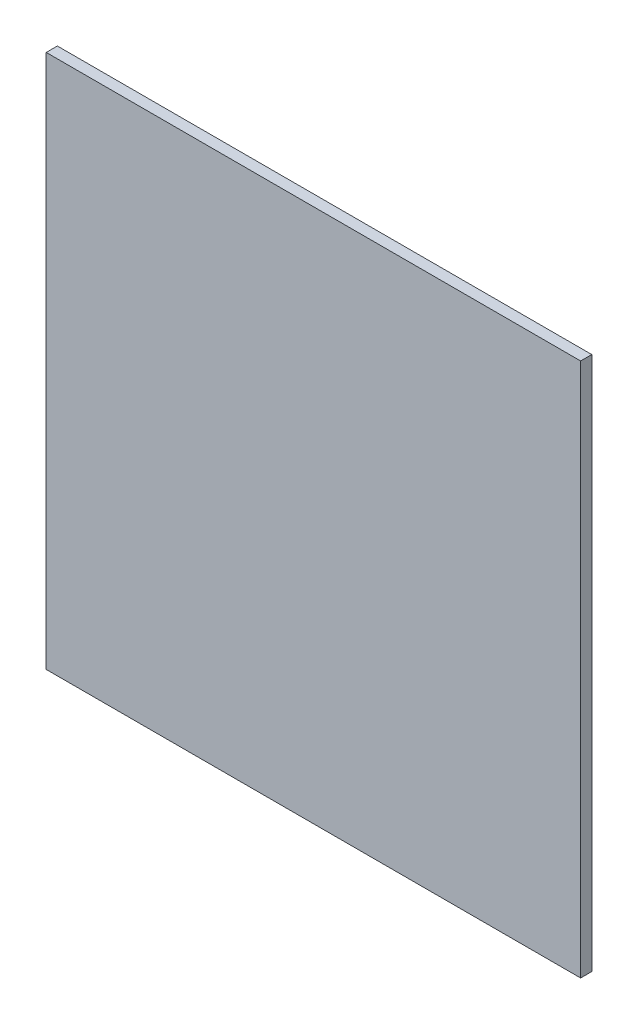
ISO-10303-21;
HEADER;
FILE_DESCRIPTION(('STEP AP214'),'2;1');
FILE_NAME('part.step','',(''),(''),'','','');
FILE_SCHEMA(('AUTOMOTIVE_DESIGN { 1 0 10303 214 1 1 1 1 }'));
ENDSEC;
DATA;
#1=APPLICATION_CONTEXT('core data for automotive mechanical design processes');
#2=APPLICATION_PROTOCOL_DEFINITION('international standard','automotive_design',2000,#1);
#3=PRODUCT_CONTEXT('',#1,'mechanical');
#4=PRODUCT('Part','Part','',(#3));
#5=PRODUCT_RELATED_PRODUCT_CATEGORY('part','',(#4));
#6=PRODUCT_DEFINITION_FORMATION('','',#4);
#7=PRODUCT_DEFINITION_CONTEXT('part definition',#1,'design');
#8=PRODUCT_DEFINITION('design','',#6,#7);
#9=PRODUCT_DEFINITION_SHAPE('','',#8);
#10=(LENGTH_UNIT() NAMED_UNIT(*) SI_UNIT(.MILLI.,.METRE.));
#11=(NAMED_UNIT(*) PLANE_ANGLE_UNIT() SI_UNIT($,.RADIAN.));
#12=(NAMED_UNIT(*) SI_UNIT($,.STERADIAN.) SOLID_ANGLE_UNIT());
#13=UNCERTAINTY_MEASURE_WITH_UNIT(LENGTH_MEASURE(1.E-05),#10,'distance_accuracy_value','');
#14=(GEOMETRIC_REPRESENTATION_CONTEXT(3) GLOBAL_UNCERTAINTY_ASSIGNED_CONTEXT((#13)) GLOBAL_UNIT_ASSIGNED_CONTEXT((#10,
#11,#12)) REPRESENTATION_CONTEXT('',''));
#15=CARTESIAN_POINT('',(0.,0.,0.));
#16=DIRECTION('',(0.,0.,1.));
#17=DIRECTION('',(1.,0.,0.));
#18=AXIS2_PLACEMENT_3D('',#15,#16,#17);
#19=CARTESIAN_POINT('',(304.8,-304.8,12.7));
#20=DIRECTION('',(-1.,0.,0.));
#21=DIRECTION('',(0.,0.,1.));
#22=AXIS2_PLACEMENT_3D('',#19,#20,#21);
#23=PLANE('',#22);
#24=DIRECTION('',(0.,1.,0.));
#25=VECTOR('',#24,1.);
#26=CARTESIAN_POINT('',(304.8,-304.8,0.));
#27=LINE('',#26,#25);
#28=CARTESIAN_POINT('',(304.8,-304.8,0.));
#29=VERTEX_POINT('',#28);
#30=CARTESIAN_POINT('',(304.8,304.8,0.));
#31=VERTEX_POINT('',#30);
#32=EDGE_CURVE('E96',#29,#31,#27,.T.);
#33=ORIENTED_EDGE('',*,*,#32,.T.);
#34=DIRECTION('',(0.,0.,-1.));
#35=VECTOR('',#34,1.);
#36=CARTESIAN_POINT('',(304.8,304.8,12.7));
#37=LINE('',#36,#35);
#38=CARTESIAN_POINT('',(304.8,304.8,12.7));
#39=VERTEX_POINT('',#38);
#40=EDGE_CURVE('E11',#39,#31,#37,.T.);
#41=ORIENTED_EDGE('',*,*,#40,.F.);
#42=DIRECTION('',(0.,1.,0.));
#43=VECTOR('',#42,1.);
#44=CARTESIAN_POINT('',(304.8,-304.8,12.7));
#45=LINE('',#44,#43);
#46=CARTESIAN_POINT('',(304.8,-304.8,12.7));
#47=VERTEX_POINT('',#46);
#48=EDGE_CURVE('E84',#47,#39,#45,.T.);
#49=ORIENTED_EDGE('',*,*,#48,.F.);
#50=DIRECTION('',(0.,0.,-1.));
#51=VECTOR('',#50,1.);
#52=CARTESIAN_POINT('',(304.8,-304.8,12.7));
#53=LINE('',#52,#51);
#54=EDGE_CURVE('E92',#47,#29,#53,.T.);
#55=ORIENTED_EDGE('',*,*,#54,.T.);
#56=EDGE_LOOP('',(#33,#41,#49,#55));
#57=FACE_BOUND('',#56,.T.);
#58=ADVANCED_FACE('F33',(#57),#23,.F.);
#59=CARTESIAN_POINT('',(-304.8,304.8,12.7));
#60=DIRECTION('',(0.,-1.,0.));
#61=DIRECTION('',(0.,0.,-1.));
#62=AXIS2_PLACEMENT_3D('',#59,#60,#61);
#63=PLANE('',#62);
#64=DIRECTION('',(-1.,0.,0.));
#65=VECTOR('',#64,1.);
#66=CARTESIAN_POINT('',(-304.8,304.8,0.));
#67=LINE('',#66,#65);
#68=CARTESIAN_POINT('',(-304.8,304.8,0.));
#69=VERTEX_POINT('',#68);
#70=EDGE_CURVE('E88',#31,#69,#67,.T.);
#71=ORIENTED_EDGE('',*,*,#70,.T.);
#72=DIRECTION('',(0.,0.,-1.));
#73=VECTOR('',#72,1.);
#74=CARTESIAN_POINT('',(-304.8,304.8,12.7));
#75=LINE('',#74,#73);
#76=CARTESIAN_POINT('',(-304.8,304.8,12.7));
#77=VERTEX_POINT('',#76);
#78=EDGE_CURVE('E41',#77,#69,#75,.T.);
#79=ORIENTED_EDGE('',*,*,#78,.F.);
#80=DIRECTION('',(-1.,0.,0.));
#81=VECTOR('',#80,1.);
#82=CARTESIAN_POINT('',(-304.8,304.8,12.7));
#83=LINE('',#82,#81);
#84=EDGE_CURVE('E79',#39,#77,#83,.T.);
#85=ORIENTED_EDGE('',*,*,#84,.F.);
#86=ORIENTED_EDGE('',*,*,#40,.T.);
#87=EDGE_LOOP('',(#71,#79,#85,#86));
#88=FACE_BOUND('',#87,.T.);
#89=ADVANCED_FACE('F87',(#88),#63,.F.);
#90=CARTESIAN_POINT('',(-304.8,-304.8,12.7));
#91=DIRECTION('',(1.,0.,0.));
#92=DIRECTION('',(0.,0.,-1.));
#93=AXIS2_PLACEMENT_3D('',#90,#91,#92);
#94=PLANE('',#93);
#95=DIRECTION('',(0.,-1.,0.));
#96=VECTOR('',#95,1.);
#97=CARTESIAN_POINT('',(-304.8,-304.8,0.));
#98=LINE('',#97,#96);
#99=CARTESIAN_POINT('',(-304.8,-304.8,0.));
#100=VERTEX_POINT('',#99);
#101=EDGE_CURVE('E66',#69,#100,#98,.T.);
#102=ORIENTED_EDGE('',*,*,#101,.T.);
#103=DIRECTION('',(0.,0.,-1.));
#104=VECTOR('',#103,1.);
#105=CARTESIAN_POINT('',(-304.8,-304.8,12.7));
#106=LINE('',#105,#104);
#107=CARTESIAN_POINT('',(-304.8,-304.8,12.7));
#108=VERTEX_POINT('',#107);
#109=EDGE_CURVE('E89',#108,#100,#106,.T.);
#110=ORIENTED_EDGE('',*,*,#109,.F.);
#111=DIRECTION('',(0.,-1.,0.));
#112=VECTOR('',#111,1.);
#113=CARTESIAN_POINT('',(-304.8,-304.8,12.7));
#114=LINE('',#113,#112);
#115=EDGE_CURVE('E82',#77,#108,#114,.T.);
#116=ORIENTED_EDGE('',*,*,#115,.F.);
#117=ORIENTED_EDGE('',*,*,#78,.T.);
#118=EDGE_LOOP('',(#102,#110,#116,#117));
#119=FACE_BOUND('',#118,.T.);
#120=ADVANCED_FACE('F90',(#119),#94,.F.);
#121=CARTESIAN_POINT('',(-304.8,-304.8,12.7));
#122=DIRECTION('',(0.,1.,0.));
#123=DIRECTION('',(0.,0.,1.));
#124=AXIS2_PLACEMENT_3D('',#121,#122,#123);
#125=PLANE('',#124);
#126=DIRECTION('',(1.,0.,0.));
#127=VECTOR('',#126,1.);
#128=CARTESIAN_POINT('',(-304.8,-304.8,0.));
#129=LINE('',#128,#127);
#130=EDGE_CURVE('E72',#100,#29,#129,.T.);
#131=ORIENTED_EDGE('',*,*,#130,.T.);
#132=ORIENTED_EDGE('',*,*,#54,.F.);
#133=DIRECTION('',(1.,0.,0.));
#134=VECTOR('',#133,1.);
#135=CARTESIAN_POINT('',(-304.8,-304.8,12.7));
#136=LINE('',#135,#134);
#137=EDGE_CURVE('E49',#108,#47,#136,.T.);
#138=ORIENTED_EDGE('',*,*,#137,.F.);
#139=ORIENTED_EDGE('',*,*,#109,.T.);
#140=EDGE_LOOP('',(#131,#132,#138,#139));
#141=FACE_BOUND('',#140,.T.);
#142=ADVANCED_FACE('F103',(#141),#125,.F.);
#143=CARTESIAN_POINT('',(0.,0.,12.7));
#144=DIRECTION('',(0.,0.,-1.));
#145=DIRECTION('',(-1.,0.,0.));
#146=AXIS2_PLACEMENT_3D('',#143,#144,#145);
#147=PLANE('',#146);
#148=ORIENTED_EDGE('',*,*,#48,.T.);
#149=ORIENTED_EDGE('',*,*,#84,.T.);
#150=ORIENTED_EDGE('',*,*,#115,.T.);
#151=ORIENTED_EDGE('',*,*,#137,.T.);
#152=EDGE_LOOP('',(#148,#149,#150,#151));
#153=FACE_BOUND('',#152,.T.);
#154=ADVANCED_FACE('F80',(#153),#147,.F.);
#155=CARTESIAN_POINT('',(0.,0.,0.));
#156=DIRECTION('',(0.,0.,-1.));
#157=DIRECTION('',(-1.,0.,0.));
#158=AXIS2_PLACEMENT_3D('',#155,#156,#157);
#159=PLANE('',#158);
#160=ORIENTED_EDGE('',*,*,#32,.F.);
#161=ORIENTED_EDGE('',*,*,#130,.F.);
#162=ORIENTED_EDGE('',*,*,#101,.F.);
#163=ORIENTED_EDGE('',*,*,#70,.F.);
#164=EDGE_LOOP('',(#160,#161,#162,#163));
#165=FACE_BOUND('',#164,.T.);
#166=ADVANCED_FACE('F106',(#165),#159,.T.);
#167=CLOSED_SHELL('',(#58,#89,#120,#142,#154,#166));
#168=MANIFOLD_SOLID_BREP('B2',#167);
#169=ADVANCED_BREP_SHAPE_REPRESENTATION('',(#18,#168),#14);
#170=SHAPE_DEFINITION_REPRESENTATION(#9,#169);
ENDSEC;
END-ISO-10303-21;
